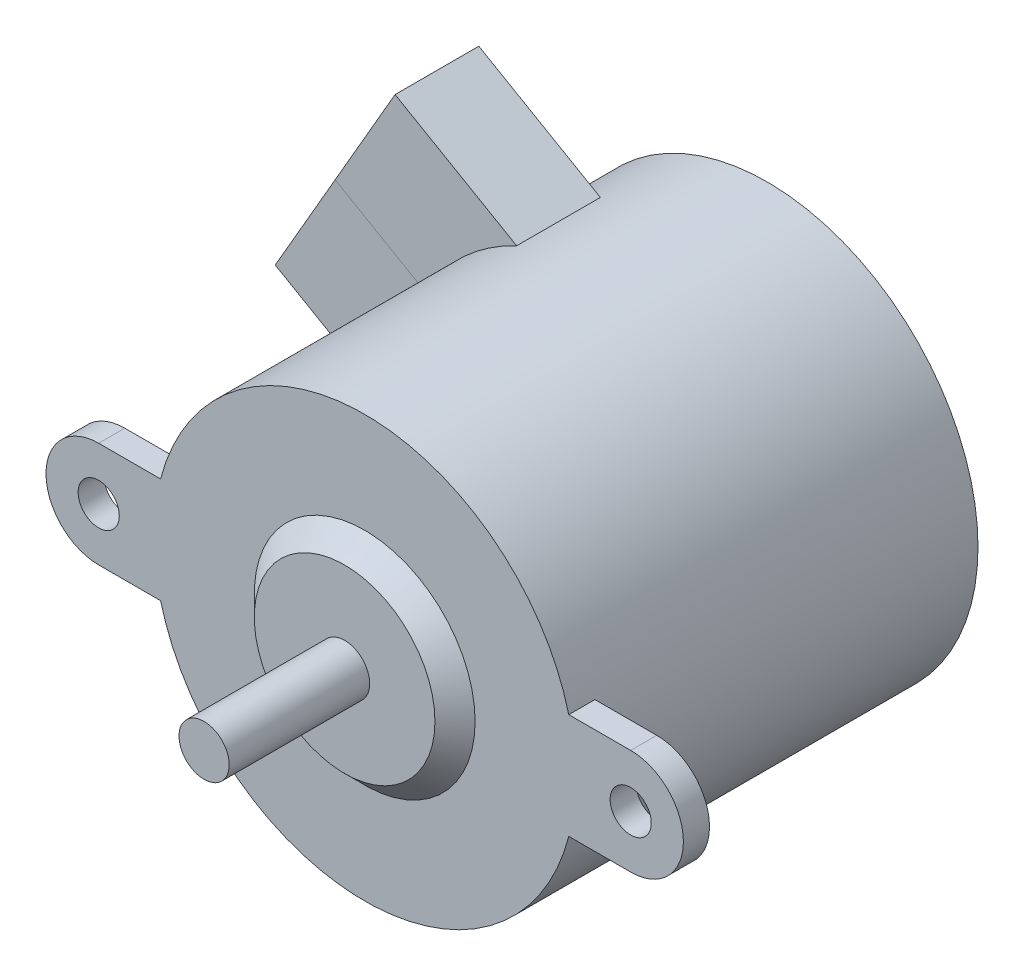
ISO-10303-21;
HEADER;
FILE_DESCRIPTION(('STEP AP214'),'2;1');
FILE_NAME('part.step','',(''),(''),'','','');
FILE_SCHEMA(('AUTOMOTIVE_DESIGN { 1 0 10303 214 1 1 1 1 }'));
ENDSEC;
DATA;
#1=APPLICATION_CONTEXT('core data for automotive mechanical design processes');
#2=APPLICATION_PROTOCOL_DEFINITION('international standard','automotive_design',2000,#1);
#3=PRODUCT_CONTEXT('',#1,'mechanical');
#4=PRODUCT('Part','Part','',(#3));
#5=PRODUCT_RELATED_PRODUCT_CATEGORY('part','',(#4));
#6=PRODUCT_DEFINITION_FORMATION('','',#4);
#7=PRODUCT_DEFINITION_CONTEXT('part definition',#1,'design');
#8=PRODUCT_DEFINITION('design','',#6,#7);
#9=PRODUCT_DEFINITION_SHAPE('','',#8);
#10=(LENGTH_UNIT() NAMED_UNIT(*) SI_UNIT(.MILLI.,.METRE.));
#11=(NAMED_UNIT(*) PLANE_ANGLE_UNIT() SI_UNIT($,.RADIAN.));
#12=(NAMED_UNIT(*) SI_UNIT($,.STERADIAN.) SOLID_ANGLE_UNIT());
#13=UNCERTAINTY_MEASURE_WITH_UNIT(LENGTH_MEASURE(1.E-05),#10,'distance_accuracy_value','');
#14=(GEOMETRIC_REPRESENTATION_CONTEXT(3) GLOBAL_UNCERTAINTY_ASSIGNED_CONTEXT((#13)) GLOBAL_UNIT_ASSIGNED_CONTEXT((#10,
#11,#12)) REPRESENTATION_CONTEXT('',''));
#15=CARTESIAN_POINT('',(0.,0.,0.));
#16=DIRECTION('',(0.,0.,1.));
#17=DIRECTION('',(1.,0.,0.));
#18=AXIS2_PLACEMENT_3D('',#15,#16,#17);
#19=CARTESIAN_POINT('',(26.5,5.25,-40.1));
#20=DIRECTION('',(0.,1.,0.));
#21=DIRECTION('',(-1.,0.,0.));
#22=AXIS2_PLACEMENT_3D('',#19,#20,#21);
#23=PLANE('',#22);
#24=DIRECTION('',(0.,0.,1.));
#25=VECTOR('',#24,1.);
#26=CARTESIAN_POINT('',(26.5,5.25,-40.1));
#27=LINE('',#26,#25);
#28=CARTESIAN_POINT('',(26.5,5.25,-2.6));
#29=VERTEX_POINT('',#28);
#30=CARTESIAN_POINT('',(26.5,5.25,0.));
#31=VERTEX_POINT('',#30);
#32=EDGE_CURVE('E219',#29,#31,#27,.T.);
#33=ORIENTED_EDGE('',*,*,#32,.F.);
#34=DIRECTION('',(1.,0.,0.));
#35=VECTOR('',#34,1.);
#36=CARTESIAN_POINT('',(26.5,5.25,-2.6));
#37=LINE('',#36,#35);
#38=CARTESIAN_POINT('',(20.3331625675889,5.25,-2.6));
#39=VERTEX_POINT('',#38);
#40=EDGE_CURVE('E235',#39,#29,#37,.T.);
#41=ORIENTED_EDGE('',*,*,#40,.F.);
#42=DIRECTION('',(0.,0.,1.));
#43=VECTOR('',#42,1.);
#44=CARTESIAN_POINT('',(20.3331625675889,5.25,-40.1));
#45=LINE('',#44,#43);
#46=CARTESIAN_POINT('',(20.3331625675889,5.25,0.));
#47=VERTEX_POINT('',#46);
#48=EDGE_CURVE('E334',#39,#47,#45,.T.);
#49=ORIENTED_EDGE('',*,*,#48,.T.);
#50=DIRECTION('',(-1.,0.,0.));
#51=VECTOR('',#50,1.);
#52=CARTESIAN_POINT('',(26.5,5.25,0.));
#53=LINE('',#52,#51);
#54=EDGE_CURVE('E313',#31,#47,#53,.T.);
#55=ORIENTED_EDGE('',*,*,#54,.F.);
#56=EDGE_LOOP('',(#33,#41,#49,#55));
#57=FACE_BOUND('',#56,.T.);
#58=ADVANCED_FACE('F79',(#57),#23,.T.);
#59=CARTESIAN_POINT('',(26.5,0.,-40.1));
#60=DIRECTION('',(0.,0.,1.));
#61=DIRECTION('',(1.,0.,0.));
#62=AXIS2_PLACEMENT_3D('',#59,#60,#61);
#63=CYLINDRICAL_SURFACE('',#62,5.25);
#64=DIRECTION('',(0.,0.,1.));
#65=VECTOR('',#64,1.);
#66=CARTESIAN_POINT('',(26.5,-5.25,-40.1));
#67=LINE('',#66,#65);
#68=CARTESIAN_POINT('',(26.5,-5.25,-2.6));
#69=VERTEX_POINT('',#68);
#70=CARTESIAN_POINT('',(26.5,-5.25,0.));
#71=VERTEX_POINT('',#70);
#72=EDGE_CURVE('E317',#69,#71,#67,.T.);
#73=ORIENTED_EDGE('',*,*,#72,.F.);
#74=CARTESIAN_POINT('',(26.5,0.,-2.6));
#75=DIRECTION('',(0.,0.,-1.));
#76=DIRECTION('',(-1.,0.,0.));
#77=AXIS2_PLACEMENT_3D('',#74,#75,#76);
#78=CIRCLE('',#77,5.25);
#79=EDGE_CURVE('E227',#29,#69,#78,.T.);
#80=ORIENTED_EDGE('',*,*,#79,.F.);
#81=ORIENTED_EDGE('',*,*,#32,.T.);
#82=CARTESIAN_POINT('',(26.5,0.,0.));
#83=DIRECTION('',(0.,0.,1.));
#84=DIRECTION('',(1.,0.,0.));
#85=AXIS2_PLACEMENT_3D('',#82,#83,#84);
#86=CIRCLE('',#85,5.25);
#87=EDGE_CURVE('E322',#71,#31,#86,.T.);
#88=ORIENTED_EDGE('',*,*,#87,.F.);
#89=EDGE_LOOP('',(#73,#80,#81,#88));
#90=FACE_BOUND('',#89,.T.);
#91=ADVANCED_FACE('F283',(#90),#63,.T.);
#92=CARTESIAN_POINT('',(26.5,-5.25,-40.1));
#93=DIRECTION('',(0.,1.,0.));
#94=DIRECTION('',(-1.,0.,0.));
#95=AXIS2_PLACEMENT_3D('',#92,#93,#94);
#96=PLANE('',#95);
#97=DIRECTION('',(-1.,0.,0.));
#98=VECTOR('',#97,1.);
#99=CARTESIAN_POINT('',(26.5,-5.25,-2.6));
#100=LINE('',#99,#98);
#101=CARTESIAN_POINT('',(20.3331625675889,-5.25,-2.6));
#102=VERTEX_POINT('',#101);
#103=EDGE_CURVE('E244',#69,#102,#100,.T.);
#104=ORIENTED_EDGE('',*,*,#103,.F.);
#105=ORIENTED_EDGE('',*,*,#72,.T.);
#106=DIRECTION('',(-1.,0.,0.));
#107=VECTOR('',#106,1.);
#108=CARTESIAN_POINT('',(26.5,-5.25,0.));
#109=LINE('',#108,#107);
#110=CARTESIAN_POINT('',(20.3331625675889,-5.25000000000001,0.));
#111=VERTEX_POINT('',#110);
#112=EDGE_CURVE('E399',#71,#111,#109,.T.);
#113=ORIENTED_EDGE('',*,*,#112,.T.);
#114=DIRECTION('',(0.,0.,1.));
#115=VECTOR('',#114,1.);
#116=CARTESIAN_POINT('',(20.3331625675889,-5.25000000000001,-40.1));
#117=LINE('',#116,#115);
#118=EDGE_CURVE('E319',#102,#111,#117,.T.);
#119=ORIENTED_EDGE('',*,*,#118,.F.);
#120=EDGE_LOOP('',(#104,#105,#113,#119));
#121=FACE_BOUND('',#120,.T.);
#122=ADVANCED_FACE('F281',(#121),#96,.F.);
#123=CARTESIAN_POINT('',(0.,0.,0.));
#124=DIRECTION('',(0.,0.,1.));
#125=DIRECTION('',(1.,0.,0.));
#126=AXIS2_PLACEMENT_3D('',#123,#124,#125);
#127=PLANE('',#126);
#128=CARTESIAN_POINT('',(-26.5,0.,0.));
#129=DIRECTION('',(0.,0.,1.));
#130=DIRECTION('',(1.,0.,0.));
#131=AXIS2_PLACEMENT_3D('',#128,#129,#130);
#132=CIRCLE('',#131,2.05);
#133=CARTESIAN_POINT('',(-24.45,0.,0.));
#134=VERTEX_POINT('',#133);
#135=EDGE_CURVE('E220',#134,#134,#132,.T.);
#136=ORIENTED_EDGE('',*,*,#135,.F.);
#137=EDGE_LOOP('',(#136));
#138=FACE_BOUND('',#137,.T.);
#139=CARTESIAN_POINT('',(26.5,0.,0.));
#140=DIRECTION('',(0.,0.,1.));
#141=DIRECTION('',(-1.,0.,0.));
#142=AXIS2_PLACEMENT_3D('',#139,#140,#141);
#143=CIRCLE('',#142,2.05);
#144=CARTESIAN_POINT('',(24.45,0.,0.));
#145=VERTEX_POINT('',#144);
#146=EDGE_CURVE('E215',#145,#145,#143,.T.);
#147=ORIENTED_EDGE('',*,*,#146,.F.);
#148=EDGE_LOOP('',(#147));
#149=FACE_BOUND('',#148,.T.);
#150=ORIENTED_EDGE('',*,*,#54,.T.);
#151=CARTESIAN_POINT('',(0.,0.,0.));
#152=DIRECTION('',(0.,0.,1.));
#153=DIRECTION('',(1.,0.,0.));
#154=AXIS2_PLACEMENT_3D('',#151,#152,#153);
#155=CIRCLE('',#154,21.);
#156=CARTESIAN_POINT('',(-20.3331625675889,5.25,0.));
#157=VERTEX_POINT('',#156);
#158=EDGE_CURVE('E415',#47,#157,#155,.T.);
#159=ORIENTED_EDGE('',*,*,#158,.T.);
#160=DIRECTION('',(1.,0.,0.));
#161=VECTOR('',#160,1.);
#162=CARTESIAN_POINT('',(-26.5,5.25,0.));
#163=LINE('',#162,#161);
#164=CARTESIAN_POINT('',(-26.5,5.25,0.));
#165=VERTEX_POINT('',#164);
#166=EDGE_CURVE('E412',#165,#157,#163,.T.);
#167=ORIENTED_EDGE('',*,*,#166,.F.);
#168=CARTESIAN_POINT('',(-26.5,0.,0.));
#169=DIRECTION('',(0.,0.,-1.));
#170=DIRECTION('',(-1.,0.,0.));
#171=AXIS2_PLACEMENT_3D('',#168,#169,#170);
#172=CIRCLE('',#171,5.25);
#173=CARTESIAN_POINT('',(-26.5,-5.25,0.));
#174=VERTEX_POINT('',#173);
#175=EDGE_CURVE('E409',#174,#165,#172,.T.);
#176=ORIENTED_EDGE('',*,*,#175,.F.);
#177=DIRECTION('',(1.,0.,0.));
#178=VECTOR('',#177,1.);
#179=CARTESIAN_POINT('',(-26.5,-5.25,0.));
#180=LINE('',#179,#178);
#181=CARTESIAN_POINT('',(-20.3331625675889,-5.25,0.));
#182=VERTEX_POINT('',#181);
#183=EDGE_CURVE('E404',#174,#182,#180,.T.);
#184=ORIENTED_EDGE('',*,*,#183,.T.);
#185=CARTESIAN_POINT('',(0.,0.,0.));
#186=DIRECTION('',(0.,0.,1.));
#187=DIRECTION('',(1.,0.,0.));
#188=AXIS2_PLACEMENT_3D('',#185,#186,#187);
#189=CIRCLE('',#188,21.);
#190=EDGE_CURVE('E402',#182,#111,#189,.T.);
#191=ORIENTED_EDGE('',*,*,#190,.T.);
#192=ORIENTED_EDGE('',*,*,#112,.F.);
#193=ORIENTED_EDGE('',*,*,#87,.T.);
#194=EDGE_LOOP('',(#150,#159,#167,#176,#184,#191,#192,#193));
#195=FACE_BOUND('',#194,.T.);
#196=CARTESIAN_POINT('',(0.,0.,0.));
#197=DIRECTION('',(0.,0.,1.));
#198=DIRECTION('',(1.,0.,0.));
#199=AXIS2_PLACEMENT_3D('',#196,#197,#198);
#200=CIRCLE('',#199,11.);
#201=CARTESIAN_POINT('',(11.,0.,0.));
#202=VERTEX_POINT('',#201);
#203=EDGE_CURVE('E418',#202,#202,#200,.T.);
#204=ORIENTED_EDGE('',*,*,#203,.F.);
#205=EDGE_LOOP('',(#204));
#206=FACE_BOUND('',#205,.T.);
#207=ADVANCED_FACE('F278',(#138,#149,#195,#206),#127,.T.);
#208=CARTESIAN_POINT('',(0.,0.,-40.1));
#209=DIRECTION('',(0.,0.,1.));
#210=DIRECTION('',(1.,0.,0.));
#211=AXIS2_PLACEMENT_3D('',#208,#209,#210);
#212=CYLINDRICAL_SURFACE('',#211,21.);
#213=DIRECTION('',(0.,0.,-1.));
#214=VECTOR('',#213,1.);
#215=CARTESIAN_POINT('',(-8.99097894732666,18.9779423955478,-24.13));
#216=LINE('',#215,#214);
#217=CARTESIAN_POINT('',(-8.99097894732666,18.9779423955478,-24.13));
#218=VERTEX_POINT('',#217);
#219=CARTESIAN_POINT('',(-8.99097894732666,18.9779423955478,-32.4706534033809));
#220=VERTEX_POINT('',#219);
#221=EDGE_CURVE('E170',#218,#220,#216,.T.);
#222=ORIENTED_EDGE('',*,*,#221,.F.);
#223=CARTESIAN_POINT('',(0.,0.,-24.13));
#224=DIRECTION('',(0.,0.,1.));
#225=DIRECTION('',(-0.866025403784439,0.5,0.));
#226=AXIS2_PLACEMENT_3D('',#223,#224,#225);
#227=CIRCLE('',#226,21.);
#228=CARTESIAN_POINT('',(-18.1865334794732,10.5,-24.13));
#229=VERTEX_POINT('',#228);
#230=EDGE_CURVE('E179',#218,#229,#227,.T.);
#231=ORIENTED_EDGE('',*,*,#230,.T.);
#232=CARTESIAN_POINT('',(0.,0.,-24.13));
#233=DIRECTION('',(0.,0.,1.));
#234=DIRECTION('',(-0.996708080941209,-0.0810740487856157,0.));
#235=AXIS2_PLACEMENT_3D('',#232,#233,#234);
#236=CIRCLE('',#235,21.);
#237=CARTESIAN_POINT('',(-20.9308696997654,-1.70255502449793,-24.13));
#238=VERTEX_POINT('',#237);
#239=EDGE_CURVE('E201',#229,#238,#236,.T.);
#240=ORIENTED_EDGE('',*,*,#239,.T.);
#241=DIRECTION('',(0.,0.,1.));
#242=VECTOR('',#241,1.);
#243=CARTESIAN_POINT('',(-20.9308696997654,-1.70255502449793,-32.4706534033809));
#244=LINE('',#243,#242);
#245=CARTESIAN_POINT('',(-20.9308696997654,-1.70255502449793,-32.4706534033809));
#246=VERTEX_POINT('',#245);
#247=EDGE_CURVE('E195',#246,#238,#244,.T.);
#248=ORIENTED_EDGE('',*,*,#247,.F.);
#249=CARTESIAN_POINT('',(0.,0.,-32.4706534033809));
#250=DIRECTION('',(0.,0.,1.));
#251=DIRECTION('',(-0.996708080941209,-0.0810740487856157,0.));
#252=AXIS2_PLACEMENT_3D('',#249,#250,#251);
#253=CIRCLE('',#252,21.);
#254=EDGE_CURVE('E180',#220,#246,#253,.T.);
#255=ORIENTED_EDGE('',*,*,#254,.F.);
#256=EDGE_LOOP('',(#222,#231,#240,#248,#255));
#257=FACE_BOUND('',#256,.T.);
#258=CARTESIAN_POINT('',(0.,0.,-2.6));
#259=DIRECTION('',(0.,0.,1.));
#260=DIRECTION('',(-1.,0.,0.));
#261=AXIS2_PLACEMENT_3D('',#258,#259,#260);
#262=CIRCLE('',#261,21.);
#263=EDGE_CURVE('E247',#102,#39,#262,.T.);
#264=ORIENTED_EDGE('',*,*,#263,.F.);
#265=ORIENTED_EDGE('',*,*,#118,.T.);
#266=ORIENTED_EDGE('',*,*,#190,.F.);
#267=DIRECTION('',(0.,0.,1.));
#268=VECTOR('',#267,1.);
#269=CARTESIAN_POINT('',(-20.3331625675889,-5.25,-40.1));
#270=LINE('',#269,#268);
#271=CARTESIAN_POINT('',(-20.3331625675889,-5.25000000000001,-2.6));
#272=VERTEX_POINT('',#271);
#273=EDGE_CURVE('E326',#272,#182,#270,.T.);
#274=ORIENTED_EDGE('',*,*,#273,.F.);
#275=CARTESIAN_POINT('',(0.,0.,-2.6));
#276=DIRECTION('',(0.,0.,1.));
#277=DIRECTION('',(1.,0.,0.));
#278=AXIS2_PLACEMENT_3D('',#275,#276,#277);
#279=CIRCLE('',#278,21.);
#280=CARTESIAN_POINT('',(-20.3331625675889,5.25,-2.6));
#281=VERTEX_POINT('',#280);
#282=EDGE_CURVE('E232',#281,#272,#279,.T.);
#283=ORIENTED_EDGE('',*,*,#282,.F.);
#284=DIRECTION('',(0.,0.,1.));
#285=VECTOR('',#284,1.);
#286=CARTESIAN_POINT('',(-20.3331625675889,5.25,-40.1));
#287=LINE('',#286,#285);
#288=EDGE_CURVE('E332',#281,#157,#287,.T.);
#289=ORIENTED_EDGE('',*,*,#288,.T.);
#290=ORIENTED_EDGE('',*,*,#158,.F.);
#291=ORIENTED_EDGE('',*,*,#48,.F.);
#292=EDGE_LOOP('',(#264,#265,#266,#274,#283,#289,#290,#291));
#293=FACE_BOUND('',#292,.T.);
#294=CARTESIAN_POINT('',(0.,0.,-40.1));
#295=DIRECTION('',(0.,0.,1.));
#296=DIRECTION('',(1.,0.,0.));
#297=AXIS2_PLACEMENT_3D('',#294,#295,#296);
#298=CIRCLE('',#297,21.);
#299=CARTESIAN_POINT('',(21.,0.,-40.1));
#300=VERTEX_POINT('',#299);
#301=EDGE_CURVE('E335',#300,#300,#298,.T.);
#302=ORIENTED_EDGE('',*,*,#301,.T.);
#303=EDGE_LOOP('',(#302));
#304=FACE_BOUND('',#303,.T.);
#305=ADVANCED_FACE('F192',(#257,#293,#304),#212,.T.);
#306=CARTESIAN_POINT('',(-26.5,-5.25,-40.1));
#307=DIRECTION('',(0.,-1.,0.));
#308=DIRECTION('',(1.,0.,0.));
#309=AXIS2_PLACEMENT_3D('',#306,#307,#308);
#310=PLANE('',#309);
#311=DIRECTION('',(-1.,0.,0.));
#312=VECTOR('',#311,1.);
#313=CARTESIAN_POINT('',(-26.5,-5.25,-2.6));
#314=LINE('',#313,#312);
#315=CARTESIAN_POINT('',(-26.5,-5.25,-2.6));
#316=VERTEX_POINT('',#315);
#317=EDGE_CURVE('E234',#272,#316,#314,.T.);
#318=ORIENTED_EDGE('',*,*,#317,.F.);
#319=ORIENTED_EDGE('',*,*,#273,.T.);
#320=ORIENTED_EDGE('',*,*,#183,.F.);
#321=DIRECTION('',(0.,0.,1.));
#322=VECTOR('',#321,1.);
#323=CARTESIAN_POINT('',(-26.5,-5.25,-40.1));
#324=LINE('',#323,#322);
#325=EDGE_CURVE('E328',#316,#174,#324,.T.);
#326=ORIENTED_EDGE('',*,*,#325,.F.);
#327=EDGE_LOOP('',(#318,#319,#320,#326));
#328=FACE_BOUND('',#327,.T.);
#329=ADVANCED_FACE('F292',(#328),#310,.T.);
#330=CARTESIAN_POINT('',(-26.5,0.,-40.1));
#331=DIRECTION('',(0.,0.,1.));
#332=DIRECTION('',(1.,0.,0.));
#333=AXIS2_PLACEMENT_3D('',#330,#331,#332);
#334=CYLINDRICAL_SURFACE('',#333,5.25);
#335=DIRECTION('',(0.,0.,1.));
#336=VECTOR('',#335,1.);
#337=CARTESIAN_POINT('',(-26.5,5.25,-40.1));
#338=LINE('',#337,#336);
#339=CARTESIAN_POINT('',(-26.5,5.25,-2.6));
#340=VERTEX_POINT('',#339);
#341=EDGE_CURVE('E330',#340,#165,#338,.T.);
#342=ORIENTED_EDGE('',*,*,#341,.F.);
#343=CARTESIAN_POINT('',(-26.5,0.,-2.6));
#344=DIRECTION('',(0.,0.,-1.));
#345=DIRECTION('',(1.,0.,0.));
#346=AXIS2_PLACEMENT_3D('',#343,#344,#345);
#347=CIRCLE('',#346,5.25);
#348=EDGE_CURVE('E237',#316,#340,#347,.T.);
#349=ORIENTED_EDGE('',*,*,#348,.F.);
#350=ORIENTED_EDGE('',*,*,#325,.T.);
#351=ORIENTED_EDGE('',*,*,#175,.T.);
#352=EDGE_LOOP('',(#342,#349,#350,#351));
#353=FACE_BOUND('',#352,.T.);
#354=ADVANCED_FACE('F295',(#353),#334,.T.);
#355=CARTESIAN_POINT('',(-26.5,5.25,-40.1));
#356=DIRECTION('',(0.,-1.,0.));
#357=DIRECTION('',(1.,0.,0.));
#358=AXIS2_PLACEMENT_3D('',#355,#356,#357);
#359=PLANE('',#358);
#360=ORIENTED_EDGE('',*,*,#288,.F.);
#361=DIRECTION('',(1.,0.,0.));
#362=VECTOR('',#361,1.);
#363=CARTESIAN_POINT('',(-26.5,5.25,-2.6));
#364=LINE('',#363,#362);
#365=EDGE_CURVE('E239',#340,#281,#364,.T.);
#366=ORIENTED_EDGE('',*,*,#365,.F.);
#367=ORIENTED_EDGE('',*,*,#341,.T.);
#368=ORIENTED_EDGE('',*,*,#166,.T.);
#369=EDGE_LOOP('',(#360,#366,#367,#368));
#370=FACE_BOUND('',#369,.T.);
#371=ADVANCED_FACE('F276',(#370),#359,.F.);
#372=CARTESIAN_POINT('',(0.,0.,-40.1));
#373=DIRECTION('',(0.,0.,1.));
#374=DIRECTION('',(1.,0.,0.));
#375=AXIS2_PLACEMENT_3D('',#372,#373,#374);
#376=PLANE('',#375);
#377=ORIENTED_EDGE('',*,*,#301,.F.);
#378=EDGE_LOOP('',(#377));
#379=FACE_BOUND('',#378,.T.);
#380=ADVANCED_FACE('F273',(#379),#376,.F.);
#381=CARTESIAN_POINT('',(0.,0.,2.));
#382=DIRECTION('',(0.,0.,1.));
#383=DIRECTION('',(1.,0.,0.));
#384=AXIS2_PLACEMENT_3D('',#381,#382,#383);
#385=PLANE('',#384);
#386=CARTESIAN_POINT('',(0.,0.,2.));
#387=DIRECTION('',(0.,0.,1.));
#388=DIRECTION('',(1.,0.,0.));
#389=AXIS2_PLACEMENT_3D('',#386,#387,#388);
#390=CIRCLE('',#389,2.5);
#391=CARTESIAN_POINT('',(2.5,0.,2.));
#392=VERTEX_POINT('',#391);
#393=EDGE_CURVE('E216',#392,#392,#390,.T.);
#394=ORIENTED_EDGE('',*,*,#393,.F.);
#395=EDGE_LOOP('',(#394));
#396=FACE_BOUND('',#395,.T.);
#397=CARTESIAN_POINT('',(0.,0.,2.));
#398=DIRECTION('',(0.,0.,1.));
#399=DIRECTION('',(1.,0.,0.));
#400=AXIS2_PLACEMENT_3D('',#397,#398,#399);
#401=CIRCLE('',#400,9.);
#402=CARTESIAN_POINT('',(9.,0.,2.));
#403=VERTEX_POINT('',#402);
#404=EDGE_CURVE('E242',#403,#403,#401,.T.);
#405=ORIENTED_EDGE('',*,*,#404,.T.);
#406=EDGE_LOOP('',(#405));
#407=FACE_BOUND('',#406,.T.);
#408=ADVANCED_FACE('F270',(#396,#407),#385,.T.);
#409=CARTESIAN_POINT('',(0.,0.,2.));
#410=DIRECTION('',(0.,0.,-1.));
#411=DIRECTION('',(-1.,0.,0.));
#412=AXIS2_PLACEMENT_3D('',#409,#410,#411);
#413=CONICAL_SURFACE('',#412,9.,0.785398163397448);
#414=ORIENTED_EDGE('',*,*,#404,.F.);
#415=EDGE_LOOP('',(#414));
#416=FACE_BOUND('',#415,.T.);
#417=ORIENTED_EDGE('',*,*,#203,.T.);
#418=EDGE_LOOP('',(#417));
#419=FACE_BOUND('',#418,.T.);
#420=ADVANCED_FACE('F259',(#416,#419),#413,.T.);
#421=CARTESIAN_POINT('',(26.5,0.,-2.6));
#422=DIRECTION('',(0.,0.,-1.));
#423=DIRECTION('',(-1.,0.,0.));
#424=AXIS2_PLACEMENT_3D('',#421,#422,#423);
#425=PLANE('',#424);
#426=CARTESIAN_POINT('',(26.5,0.,-2.6));
#427=DIRECTION('',(0.,0.,-1.));
#428=DIRECTION('',(-1.,0.,0.));
#429=AXIS2_PLACEMENT_3D('',#426,#427,#428);
#430=CIRCLE('',#429,2.05);
#431=CARTESIAN_POINT('',(24.45,0.,-2.6));
#432=VERTEX_POINT('',#431);
#433=EDGE_CURVE('E224',#432,#432,#430,.F.);
#434=ORIENTED_EDGE('',*,*,#433,.T.);
#435=EDGE_LOOP('',(#434));
#436=FACE_BOUND('',#435,.T.);
#437=ORIENTED_EDGE('',*,*,#79,.T.);
#438=ORIENTED_EDGE('',*,*,#103,.T.);
#439=ORIENTED_EDGE('',*,*,#263,.T.);
#440=ORIENTED_EDGE('',*,*,#40,.T.);
#441=EDGE_LOOP('',(#437,#438,#439,#440));
#442=FACE_BOUND('',#441,.T.);
#443=ADVANCED_FACE('F269',(#436,#442),#425,.T.);
#444=CARTESIAN_POINT('',(0.,0.,-2.6));
#445=DIRECTION('',(0.,0.,1.));
#446=DIRECTION('',(1.,0.,0.));
#447=AXIS2_PLACEMENT_3D('',#444,#445,#446);
#448=PLANE('',#447);
#449=CARTESIAN_POINT('',(-26.5,0.,-2.6));
#450=DIRECTION('',(0.,0.,-1.));
#451=DIRECTION('',(-1.,0.,0.));
#452=AXIS2_PLACEMENT_3D('',#449,#450,#451);
#453=CIRCLE('',#452,2.05);
#454=CARTESIAN_POINT('',(-28.55,0.,-2.6));
#455=VERTEX_POINT('',#454);
#456=EDGE_CURVE('E223',#455,#455,#453,.F.);
#457=ORIENTED_EDGE('',*,*,#456,.T.);
#458=EDGE_LOOP('',(#457));
#459=FACE_BOUND('',#458,.T.);
#460=ORIENTED_EDGE('',*,*,#282,.T.);
#461=ORIENTED_EDGE('',*,*,#317,.T.);
#462=ORIENTED_EDGE('',*,*,#348,.T.);
#463=ORIENTED_EDGE('',*,*,#365,.T.);
#464=EDGE_LOOP('',(#460,#461,#462,#463));
#465=FACE_BOUND('',#464,.T.);
#466=ADVANCED_FACE('F380',(#459,#465),#448,.F.);
#467=CARTESIAN_POINT('',(-26.5,0.,-8.3982756057297));
#468=DIRECTION('',(0.,0.,1.));
#469=DIRECTION('',(1.,0.,0.));
#470=AXIS2_PLACEMENT_3D('',#467,#468,#469);
#471=CYLINDRICAL_SURFACE('',#470,2.05);
#472=ORIENTED_EDGE('',*,*,#135,.T.);
#473=EDGE_LOOP('',(#472));
#474=FACE_BOUND('',#473,.T.);
#475=ORIENTED_EDGE('',*,*,#456,.F.);
#476=EDGE_LOOP('',(#475));
#477=FACE_BOUND('',#476,.T.);
#478=ADVANCED_FACE('F377',(#474,#477),#471,.F.);
#479=CARTESIAN_POINT('',(26.5,0.,-8.3982756057297));
#480=DIRECTION('',(0.,0.,1.));
#481=DIRECTION('',(1.,0.,0.));
#482=AXIS2_PLACEMENT_3D('',#479,#480,#481);
#483=CYLINDRICAL_SURFACE('',#482,2.05);
#484=ORIENTED_EDGE('',*,*,#146,.T.);
#485=EDGE_LOOP('',(#484));
#486=FACE_BOUND('',#485,.T.);
#487=ORIENTED_EDGE('',*,*,#433,.F.);
#488=EDGE_LOOP('',(#487));
#489=FACE_BOUND('',#488,.T.);
#490=ADVANCED_FACE('F375',(#486,#489),#483,.F.);
#491=CARTESIAN_POINT('',(0.,0.,16.));
#492=DIRECTION('',(0.,0.,-1.));
#493=DIRECTION('',(-1.,0.,0.));
#494=AXIS2_PLACEMENT_3D('',#491,#492,#493);
#495=CYLINDRICAL_SURFACE('',#494,2.5);
#496=CARTESIAN_POINT('',(0.,0.,16.));
#497=DIRECTION('',(0.,0.,1.));
#498=DIRECTION('',(1.,0.,0.));
#499=AXIS2_PLACEMENT_3D('',#496,#497,#498);
#500=CIRCLE('',#499,2.5);
#501=CARTESIAN_POINT('',(2.5,0.,16.));
#502=VERTEX_POINT('',#501);
#503=EDGE_CURVE('E212',#502,#502,#500,.T.);
#504=ORIENTED_EDGE('',*,*,#503,.F.);
#505=EDGE_LOOP('',(#504));
#506=FACE_BOUND('',#505,.T.);
#507=ORIENTED_EDGE('',*,*,#393,.T.);
#508=EDGE_LOOP('',(#507));
#509=FACE_BOUND('',#508,.T.);
#510=ADVANCED_FACE('F371',(#506,#509),#495,.T.);
#511=CARTESIAN_POINT('',(0.,0.,16.));
#512=DIRECTION('',(0.,0.,1.));
#513=DIRECTION('',(1.,0.,0.));
#514=AXIS2_PLACEMENT_3D('',#511,#512,#513);
#515=PLANE('',#514);
#516=ORIENTED_EDGE('',*,*,#503,.T.);
#517=EDGE_LOOP('',(#516));
#518=FACE_BOUND('',#517,.T.);
#519=ADVANCED_FACE('F368',(#518),#515,.T.);
#520=CARTESIAN_POINT('',(0.,0.,-32.4706534033809));
#521=DIRECTION('',(0.,0.,-1.));
#522=DIRECTION('',(-1.,0.,0.));
#523=AXIS2_PLACEMENT_3D('',#520,#521,#522);
#524=PLANE('',#523);
#525=DIRECTION('',(-0.866025403784439,0.5,0.));
#526=VECTOR('',#525,1.);
#527=CARTESIAN_POINT('',(-8.99097894732666,18.9779423955478,-32.4706534033809));
#528=LINE('',#527,#526);
#529=CARTESIAN_POINT('',(-21.1022033997211,25.9703610933536,-32.4706534033809));
#530=VERTEX_POINT('',#529);
#531=EDGE_CURVE('E101',#220,#530,#528,.T.);
#532=ORIENTED_EDGE('',*,*,#531,.F.);
#533=ORIENTED_EDGE('',*,*,#254,.T.);
#534=DIRECTION('',(0.866025403784439,-0.5,0.));
#535=VECTOR('',#534,1.);
#536=CARTESIAN_POINT('',(-20.9308696997654,-1.70255502449793,-32.4706534033809));
#537=LINE('',#536,#535);
#538=CARTESIAN_POINT('',(-33.0420941521598,5.28986367330795,-32.4706534033809));
#539=VERTEX_POINT('',#538);
#540=EDGE_CURVE('E189',#539,#246,#537,.T.);
#541=ORIENTED_EDGE('',*,*,#540,.F.);
#542=DIRECTION('',(-0.5,-0.866025403784439,0.));
#543=VECTOR('',#542,1.);
#544=CARTESIAN_POINT('',(-16.2693904761149,34.341038620515,-32.4706534033809));
#545=LINE('',#544,#543);
#546=EDGE_CURVE('E188',#530,#539,#545,.T.);
#547=ORIENTED_EDGE('',*,*,#546,.F.);
#548=EDGE_LOOP('',(#532,#533,#541,#547));
#549=FACE_BOUND('',#548,.T.);
#550=ADVANCED_FACE('F185',(#549),#524,.T.);
#551=CARTESIAN_POINT('',(0.,0.,-24.13));
#552=DIRECTION('',(0.,0.,-1.));
#553=DIRECTION('',(-1.,0.,0.));
#554=AXIS2_PLACEMENT_3D('',#551,#552,#553);
#555=PLANE('',#554);
#556=DIRECTION('',(-0.866025403784439,0.5,0.));
#557=VECTOR('',#556,1.);
#558=CARTESIAN_POINT('',(5.96994537621937,10.3402487100228,-24.13));
#559=LINE('',#558,#557);
#560=CARTESIAN_POINT('',(-21.1022033997211,25.9703610933536,-24.13));
#561=VERTEX_POINT('',#560);
#562=EDGE_CURVE('E173',#561,#218,#559,.F.);
#563=ORIENTED_EDGE('',*,*,#562,.F.);
#564=DIRECTION('',(-0.5,-0.866025403784439,0.));
#565=VECTOR('',#564,1.);
#566=CARTESIAN_POINT('',(-16.2693904761149,34.341038620515,-24.13));
#567=LINE('',#566,#565);
#568=CARTESIAN_POINT('',(-27.0721487759404,15.6301123833308,-24.13));
#569=VERTEX_POINT('',#568);
#570=EDGE_CURVE('E210',#561,#569,#567,.T.);
#571=ORIENTED_EDGE('',*,*,#570,.T.);
#572=DIRECTION('',(0.866025403784439,-0.5,0.));
#573=VECTOR('',#572,1.);
#574=CARTESIAN_POINT('',(-18.1865334794732,10.5,-24.13));
#575=LINE('',#574,#573);
#576=EDGE_CURVE('E207',#569,#229,#575,.T.);
#577=ORIENTED_EDGE('',*,*,#576,.T.);
#578=ORIENTED_EDGE('',*,*,#230,.F.);
#579=EDGE_LOOP('',(#563,#571,#577,#578));
#580=FACE_BOUND('',#579,.T.);
#581=ADVANCED_FACE('F362',(#580),#555,.F.);
#582=CARTESIAN_POINT('',(0.,0.,-24.13));
#583=DIRECTION('',(0.,0.,-1.));
#584=DIRECTION('',(-1.,0.,0.));
#585=AXIS2_PLACEMENT_3D('',#582,#583,#584);
#586=PLANE('',#585);
#587=DIRECTION('',(0.866025403784439,-0.5,0.));
#588=VECTOR('',#587,1.);
#589=CARTESIAN_POINT('',(-5.96994537621937,-10.3402487100228,-24.13));
#590=LINE('',#589,#588);
#591=CARTESIAN_POINT('',(-33.0420941521598,5.28986367330796,-24.13));
#592=VERTEX_POINT('',#591);
#593=EDGE_CURVE('E93',#238,#592,#590,.F.);
#594=ORIENTED_EDGE('',*,*,#593,.F.);
#595=ORIENTED_EDGE('',*,*,#239,.F.);
#596=ORIENTED_EDGE('',*,*,#576,.F.);
#597=EDGE_CURVE('E341',#569,#592,#567,.T.);
#598=ORIENTED_EDGE('',*,*,#597,.T.);
#599=EDGE_LOOP('',(#594,#595,#596,#598));
#600=FACE_BOUND('',#599,.T.);
#601=ADVANCED_FACE('F344',(#600),#586,.F.);
#602=CARTESIAN_POINT('',(-16.2693904761149,34.341038620515,-24.13));
#603=DIRECTION('',(0.866025403784439,-0.5,0.));
#604=DIRECTION('',(0.5,0.866025403784439,0.));
#605=AXIS2_PLACEMENT_3D('',#602,#603,#604);
#606=PLANE('',#605);
#607=ORIENTED_EDGE('',*,*,#570,.F.);
#608=DIRECTION('',(0.,0.,-1.));
#609=VECTOR('',#608,1.);
#610=CARTESIAN_POINT('',(-21.1022033997211,25.9703610933536,-24.13));
#611=LINE('',#610,#609);
#612=EDGE_CURVE('E13',#561,#530,#611,.T.);
#613=ORIENTED_EDGE('',*,*,#612,.T.);
#614=ORIENTED_EDGE('',*,*,#546,.T.);
#615=DIRECTION('',(0.,0.,1.));
#616=VECTOR('',#615,1.);
#617=CARTESIAN_POINT('',(-33.0420941521598,5.28986367330796,-24.13));
#618=LINE('',#617,#616);
#619=EDGE_CURVE('E86',#539,#592,#618,.T.);
#620=ORIENTED_EDGE('',*,*,#619,.T.);
#621=ORIENTED_EDGE('',*,*,#597,.F.);
#622=EDGE_LOOP('',(#607,#613,#614,#620,#621));
#623=FACE_BOUND('',#622,.T.);
#624=ADVANCED_FACE('F340',(#623),#606,.F.);
#625=CARTESIAN_POINT('',(-20.9308696997654,-1.70255502449793,-18.4706534033809));
#626=DIRECTION('',(0.5,0.866025403784439,0.));
#627=DIRECTION('',(-0.866025403784439,0.5,0.));
#628=AXIS2_PLACEMENT_3D('',#625,#626,#627);
#629=PLANE('',#628);
#630=ORIENTED_EDGE('',*,*,#593,.T.);
#631=ORIENTED_EDGE('',*,*,#619,.F.);
#632=ORIENTED_EDGE('',*,*,#540,.T.);
#633=ORIENTED_EDGE('',*,*,#247,.T.);
#634=EDGE_LOOP('',(#630,#631,#632,#633));
#635=FACE_BOUND('',#634,.T.);
#636=ADVANCED_FACE('F350',(#635),#629,.F.);
#637=CARTESIAN_POINT('',(-8.99097894732666,18.9779423955478,-18.4706534033809));
#638=DIRECTION('',(-0.5,-0.866025403784439,0.));
#639=DIRECTION('',(0.866025403784439,-0.5,0.));
#640=AXIS2_PLACEMENT_3D('',#637,#638,#639);
#641=PLANE('',#640);
#642=ORIENTED_EDGE('',*,*,#562,.T.);
#643=ORIENTED_EDGE('',*,*,#221,.T.);
#644=ORIENTED_EDGE('',*,*,#531,.T.);
#645=ORIENTED_EDGE('',*,*,#612,.F.);
#646=EDGE_LOOP('',(#642,#643,#644,#645));
#647=FACE_BOUND('',#646,.T.);
#648=ADVANCED_FACE('F171',(#647),#641,.F.);
#649=CLOSED_SHELL('',(#58,#91,#122,#207,#305,#329,#354,#371,#380,#408,#420,#443,#466,#478,#490,
#510,#519,#550,#581,#601,#624,#636,#648));
#650=MANIFOLD_SOLID_BREP('B2',#649);
#651=ADVANCED_BREP_SHAPE_REPRESENTATION('',(#18,#650),#14);
#652=SHAPE_DEFINITION_REPRESENTATION(#9,#651);
ENDSEC;
END-ISO-10303-21;
